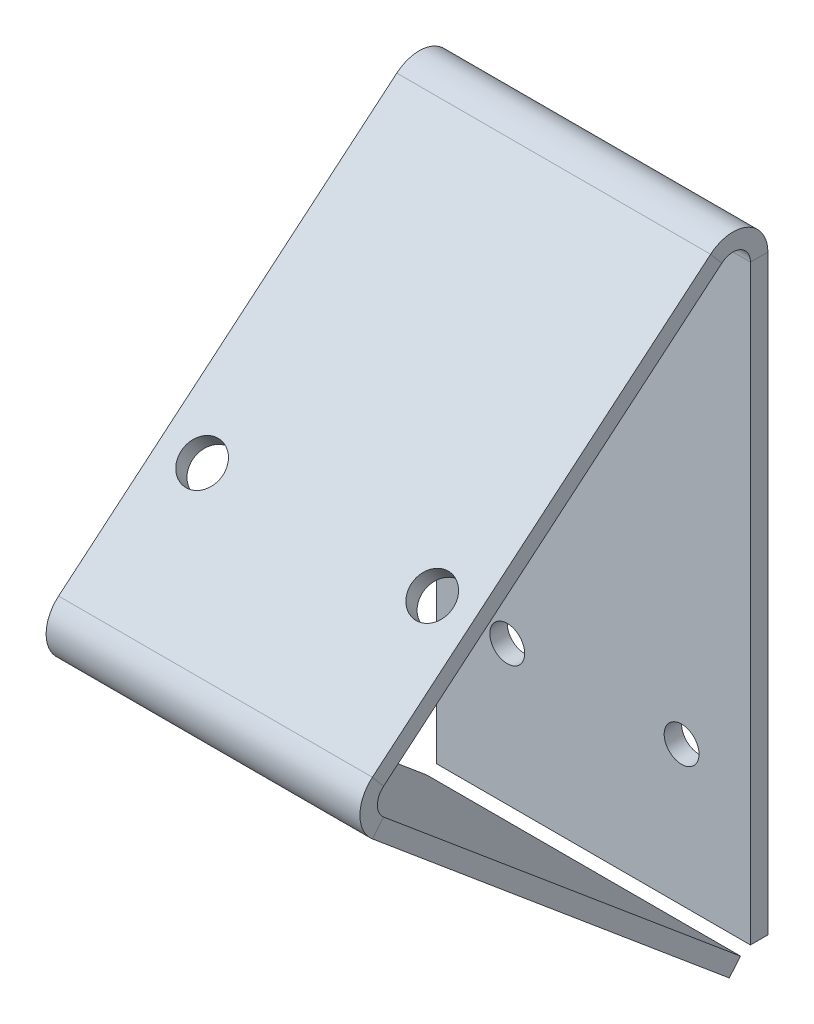
ISO-10303-21;
HEADER;
FILE_DESCRIPTION(('STEP AP214'),'2;1');
FILE_NAME('part.step','',(''),(''),'','','');
FILE_SCHEMA(('AUTOMOTIVE_DESIGN { 1 0 10303 214 1 1 1 1 }'));
ENDSEC;
DATA;
#1=APPLICATION_CONTEXT('core data for automotive mechanical design processes');
#2=APPLICATION_PROTOCOL_DEFINITION('international standard','automotive_design',2000,#1);
#3=PRODUCT_CONTEXT('',#1,'mechanical');
#4=PRODUCT('Part','Part','',(#3));
#5=PRODUCT_RELATED_PRODUCT_CATEGORY('part','',(#4));
#6=PRODUCT_DEFINITION_FORMATION('','',#4);
#7=PRODUCT_DEFINITION_CONTEXT('part definition',#1,'design');
#8=PRODUCT_DEFINITION('design','',#6,#7);
#9=PRODUCT_DEFINITION_SHAPE('','',#8);
#10=(LENGTH_UNIT() NAMED_UNIT(*) SI_UNIT(.MILLI.,.METRE.));
#11=(NAMED_UNIT(*) PLANE_ANGLE_UNIT() SI_UNIT($,.RADIAN.));
#12=(NAMED_UNIT(*) SI_UNIT($,.STERADIAN.) SOLID_ANGLE_UNIT());
#13=UNCERTAINTY_MEASURE_WITH_UNIT(LENGTH_MEASURE(1.E-05),#10,'distance_accuracy_value','');
#14=(GEOMETRIC_REPRESENTATION_CONTEXT(3) GLOBAL_UNCERTAINTY_ASSIGNED_CONTEXT((#13)) GLOBAL_UNIT_ASSIGNED_CONTEXT((#10,
#11,#12)) REPRESENTATION_CONTEXT('',''));
#15=CARTESIAN_POINT('',(0.,0.,0.));
#16=DIRECTION('',(0.,0.,1.));
#17=DIRECTION('',(1.,0.,0.));
#18=AXIS2_PLACEMENT_3D('',#15,#16,#17);
#19=CARTESIAN_POINT('',(-216.953914114597,121.828309810006,102.226089828528));
#20=DIRECTION('',(1.,0.,0.));
#21=DIRECTION('',(0.,-0.642787609686543,0.766044443118975));
#22=AXIS2_PLACEMENT_3D('',#19,#20,#21);
#23=PLANE('',#22);
#24=DIRECTION('',(0.,0.766044443118975,0.642787609686543));
#25=VECTOR('',#24,1.);
#26=CARTESIAN_POINT('',(-216.953914114597,142.748478512065,77.2944036201722));
#27=LINE('',#26,#25);
#28=CARTESIAN_POINT('',(-216.953914114597,140.316287405162,75.2535529594174));
#29=VERTEX_POINT('',#28);
#30=CARTESIAN_POINT('',(-216.953914114597,142.748478512065,77.2944036201722));
#31=VERTEX_POINT('',#30);
#32=EDGE_CURVE('E12',#29,#31,#27,.T.);
#33=ORIENTED_EDGE('',*,*,#32,.F.);
#34=DIRECTION('',(0.,0.642787609686543,-0.766044443118975));
#35=VECTOR('',#34,1.);
#36=CARTESIAN_POINT('',(-216.953914114597,119.396118703103,100.185239167773));
#37=LINE('',#36,#35);
#38=CARTESIAN_POINT('',(-216.953914114597,192.001158760502,13.657921838922));
#39=VERTEX_POINT('',#38);
#40=EDGE_CURVE('E166',#39,#29,#37,.F.);
#41=ORIENTED_EDGE('',*,*,#40,.F.);
#42=DIRECTION('',(0.,0.766044443118974,0.642787609686544));
#43=VECTOR('',#42,1.);
#44=CARTESIAN_POINT('',(-216.953914114597,194.433349867405,15.6987724996768));
#45=LINE('',#44,#43);
#46=CARTESIAN_POINT('',(-216.953914114597,194.433349867405,15.6987724996768));
#47=VERTEX_POINT('',#46);
#48=EDGE_CURVE('E56',#39,#47,#45,.T.);
#49=ORIENTED_EDGE('',*,*,#48,.T.);
#50=DIRECTION('',(0.,-0.642787609686543,0.766044443118975));
#51=VECTOR('',#50,1.);
#52=CARTESIAN_POINT('',(-216.953914114597,121.828309810006,102.226089828528));
#53=LINE('',#52,#51);
#54=EDGE_CURVE('E264',#47,#31,#53,.T.);
#55=ORIENTED_EDGE('',*,*,#54,.T.);
#56=EDGE_LOOP('',(#33,#41,#49,#55));
#57=FACE_BOUND('',#56,.T.);
#58=ADVANCED_FACE('F46',(#57),#23,.T.);
#59=CARTESIAN_POINT('',(-216.953914114597,189.5689676536,11.6170711781672));
#60=DIRECTION('',(-1.,0.,0.));
#61=DIRECTION('',(0.,0.,1.));
#62=AXIS2_PLACEMENT_3D('',#59,#60,#61);
#63=PLANE('',#62);
#64=ORIENTED_EDGE('',*,*,#48,.F.);
#65=CARTESIAN_POINT('',(-216.953914114597,189.5689676536,11.6170711781672));
#66=DIRECTION('',(-1.,0.,0.));
#67=DIRECTION('',(0.,0.,1.));
#68=AXIS2_PLACEMENT_3D('',#65,#66,#67);
#69=CIRCLE('',#68,3.175);
#70=CARTESIAN_POINT('',(-216.953914114597,189.5689676536,8.44207117816722));
#71=VERTEX_POINT('',#70);
#72=EDGE_CURVE('E170',#39,#71,#69,.T.);
#73=ORIENTED_EDGE('',*,*,#72,.T.);
#74=DIRECTION('',(0.,0.,-1.));
#75=VECTOR('',#74,1.);
#76=CARTESIAN_POINT('',(-216.953914114597,189.5689676536,5.26707117816722));
#77=LINE('',#76,#75);
#78=CARTESIAN_POINT('',(-216.953914114597,189.5689676536,5.26707117816722));
#79=VERTEX_POINT('',#78);
#80=EDGE_CURVE('E204',#71,#79,#77,.T.);
#81=ORIENTED_EDGE('',*,*,#80,.T.);
#82=CARTESIAN_POINT('',(-216.953914114597,189.5689676536,11.6170711781672));
#83=DIRECTION('',(1.,0.,0.));
#84=DIRECTION('',(0.,0.,-1.));
#85=AXIS2_PLACEMENT_3D('',#82,#83,#84);
#86=CIRCLE('',#85,6.35);
#87=EDGE_CURVE('E281',#47,#79,#86,.F.);
#88=ORIENTED_EDGE('',*,*,#87,.F.);
#89=EDGE_LOOP('',(#64,#73,#81,#88));
#90=FACE_BOUND('',#89,.T.);
#91=ADVANCED_FACE('F300',(#90),#63,.F.);
#92=CARTESIAN_POINT('',(-216.953914114597,0.,5.26707117816726));
#93=DIRECTION('',(1.,0.,0.));
#94=DIRECTION('',(0.,1.,0.));
#95=AXIS2_PLACEMENT_3D('',#92,#93,#94);
#96=PLANE('',#95);
#97=ORIENTED_EDGE('',*,*,#80,.F.);
#98=DIRECTION('',(0.,-1.,0.));
#99=VECTOR('',#98,1.);
#100=CARTESIAN_POINT('',(-216.953914114597,0.,8.44207117816726));
#101=LINE('',#100,#99);
#102=CARTESIAN_POINT('',(-216.953914114597,81.8630845770558,8.44207117816724));
#103=VERTEX_POINT('',#102);
#104=EDGE_CURVE('E156',#103,#71,#101,.F.);
#105=ORIENTED_EDGE('',*,*,#104,.F.);
#106=DIRECTION('',(0.,0.,-1.));
#107=VECTOR('',#106,1.);
#108=CARTESIAN_POINT('',(-216.953914114597,81.8630845770558,5.26707117816724));
#109=LINE('',#108,#107);
#110=CARTESIAN_POINT('',(-216.953914114597,81.8630845770558,5.26707117816724));
#111=VERTEX_POINT('',#110);
#112=EDGE_CURVE('E201',#103,#111,#109,.T.);
#113=ORIENTED_EDGE('',*,*,#112,.T.);
#114=DIRECTION('',(0.,1.,0.));
#115=VECTOR('',#114,1.);
#116=CARTESIAN_POINT('',(-216.953914114597,0.,5.26707117816726));
#117=LINE('',#116,#115);
#118=EDGE_CURVE('E248',#111,#79,#117,.T.);
#119=ORIENTED_EDGE('',*,*,#118,.T.);
#120=EDGE_LOOP('',(#97,#105,#113,#119));
#121=FACE_BOUND('',#120,.T.);
#122=ADVANCED_FACE('F246',(#121),#96,.T.);
#123=CARTESIAN_POINT('',(-216.953914114597,81.8630845770558,5.26707117816724));
#124=DIRECTION('',(0.,1.,0.));
#125=DIRECTION('',(-1.,0.,0.));
#126=AXIS2_PLACEMENT_3D('',#123,#124,#125);
#127=PLANE('',#126);
#128=ORIENTED_EDGE('',*,*,#112,.F.);
#129=DIRECTION('',(1.,0.,0.));
#130=VECTOR('',#129,1.);
#131=CARTESIAN_POINT('',(-216.953914114597,81.8630845770558,8.44207117816724));
#132=LINE('',#131,#130);
#133=CARTESIAN_POINT('',(-274.103914114597,81.8630845770558,8.44207117816724));
#134=VERTEX_POINT('',#133);
#135=EDGE_CURVE('E151',#103,#134,#132,.F.);
#136=ORIENTED_EDGE('',*,*,#135,.T.);
#137=DIRECTION('',(0.,0.,-1.));
#138=VECTOR('',#137,1.);
#139=CARTESIAN_POINT('',(-274.103914114597,81.8630845770558,5.26707117816724));
#140=LINE('',#139,#138);
#141=CARTESIAN_POINT('',(-274.103914114597,81.8630845770558,5.26707117816724));
#142=VERTEX_POINT('',#141);
#143=EDGE_CURVE('E198',#134,#142,#140,.T.);
#144=ORIENTED_EDGE('',*,*,#143,.T.);
#145=DIRECTION('',(-1.,0.,0.));
#146=VECTOR('',#145,1.);
#147=CARTESIAN_POINT('',(-216.953914114597,81.8630845770558,5.26707117816724));
#148=LINE('',#147,#146);
#149=EDGE_CURVE('E242',#111,#142,#148,.T.);
#150=ORIENTED_EDGE('',*,*,#149,.F.);
#151=EDGE_LOOP('',(#128,#136,#144,#150));
#152=FACE_BOUND('',#151,.T.);
#153=ADVANCED_FACE('F238',(#152),#127,.F.);
#154=CARTESIAN_POINT('',(-274.103914114597,0.,5.26707117816726));
#155=DIRECTION('',(1.,0.,0.));
#156=DIRECTION('',(0.,1.,0.));
#157=AXIS2_PLACEMENT_3D('',#154,#155,#156);
#158=PLANE('',#157);
#159=ORIENTED_EDGE('',*,*,#143,.F.);
#160=DIRECTION('',(0.,-1.,0.));
#161=VECTOR('',#160,1.);
#162=CARTESIAN_POINT('',(-274.103914114597,0.,8.44207117816726));
#163=LINE('',#162,#161);
#164=CARTESIAN_POINT('',(-274.103914114597,189.5689676536,8.44207117816721));
#165=VERTEX_POINT('',#164);
#166=EDGE_CURVE('E171',#134,#165,#163,.F.);
#167=ORIENTED_EDGE('',*,*,#166,.T.);
#168=DIRECTION('',(0.,0.,-1.));
#169=VECTOR('',#168,1.);
#170=CARTESIAN_POINT('',(-274.103914114597,189.5689676536,5.26707117816722));
#171=LINE('',#170,#169);
#172=CARTESIAN_POINT('',(-274.103914114597,189.5689676536,5.26707117816722));
#173=VERTEX_POINT('',#172);
#174=EDGE_CURVE('E195',#165,#173,#171,.T.);
#175=ORIENTED_EDGE('',*,*,#174,.T.);
#176=DIRECTION('',(0.,1.,0.));
#177=VECTOR('',#176,1.);
#178=CARTESIAN_POINT('',(-274.103914114597,0.,5.26707117816726));
#179=LINE('',#178,#177);
#180=EDGE_CURVE('E259',#142,#173,#179,.T.);
#181=ORIENTED_EDGE('',*,*,#180,.F.);
#182=EDGE_LOOP('',(#159,#167,#175,#181));
#183=FACE_BOUND('',#182,.T.);
#184=ADVANCED_FACE('F311',(#183),#158,.F.);
#185=CARTESIAN_POINT('',(-274.103914114597,189.5689676536,11.6170711781672));
#186=DIRECTION('',(1.,0.,0.));
#187=DIRECTION('',(0.,0.,-1.));
#188=AXIS2_PLACEMENT_3D('',#185,#186,#187);
#189=PLANE('',#188);
#190=ORIENTED_EDGE('',*,*,#174,.F.);
#191=CARTESIAN_POINT('',(-274.103914114597,189.5689676536,11.6170711781672));
#192=DIRECTION('',(-1.,0.,0.));
#193=DIRECTION('',(0.,0.,1.));
#194=AXIS2_PLACEMENT_3D('',#191,#192,#193);
#195=CIRCLE('',#194,3.175);
#196=CARTESIAN_POINT('',(-274.103914114597,192.001158760502,13.657921838922));
#197=VERTEX_POINT('',#196);
#198=EDGE_CURVE('E146',#165,#197,#195,.F.);
#199=ORIENTED_EDGE('',*,*,#198,.T.);
#200=DIRECTION('',(0.,0.766044443118975,0.642787609686543));
#201=VECTOR('',#200,1.);
#202=CARTESIAN_POINT('',(-274.103914114597,194.433349867405,15.6987724996768));
#203=LINE('',#202,#201);
#204=CARTESIAN_POINT('',(-274.103914114597,194.433349867405,15.6987724996768));
#205=VERTEX_POINT('',#204);
#206=EDGE_CURVE('E192',#197,#205,#203,.T.);
#207=ORIENTED_EDGE('',*,*,#206,.T.);
#208=CARTESIAN_POINT('',(-274.103914114597,189.5689676536,11.6170711781672));
#209=DIRECTION('',(-1.,0.,0.));
#210=DIRECTION('',(0.,0.,1.));
#211=AXIS2_PLACEMENT_3D('',#208,#209,#210);
#212=CIRCLE('',#211,6.35);
#213=EDGE_CURVE('E278',#173,#205,#212,.F.);
#214=ORIENTED_EDGE('',*,*,#213,.F.);
#215=EDGE_LOOP('',(#190,#199,#207,#214));
#216=FACE_BOUND('',#215,.T.);
#217=ADVANCED_FACE('F307',(#216),#189,.F.);
#218=CARTESIAN_POINT('',(-274.103914114597,121.828309810006,102.226089828528));
#219=DIRECTION('',(1.,0.,0.));
#220=DIRECTION('',(0.,-0.642787609686543,0.766044443118975));
#221=AXIS2_PLACEMENT_3D('',#218,#219,#220);
#222=PLANE('',#221);
#223=ORIENTED_EDGE('',*,*,#206,.F.);
#224=DIRECTION('',(0.,0.642787609686543,-0.766044443118975));
#225=VECTOR('',#224,1.);
#226=CARTESIAN_POINT('',(-274.103914114597,119.396118703103,100.185239167773));
#227=LINE('',#226,#225);
#228=CARTESIAN_POINT('',(-274.103914114597,140.316287405162,75.2535529594174));
#229=VERTEX_POINT('',#228);
#230=EDGE_CURVE('E164',#197,#229,#227,.F.);
#231=ORIENTED_EDGE('',*,*,#230,.T.);
#232=DIRECTION('',(0.,0.766044443118975,0.642787609686543));
#233=VECTOR('',#232,1.);
#234=CARTESIAN_POINT('',(-274.103914114597,142.748478512065,77.2944036201722));
#235=LINE('',#234,#233);
#236=CARTESIAN_POINT('',(-274.103914114597,142.748478512065,77.2944036201722));
#237=VERTEX_POINT('',#236);
#238=EDGE_CURVE('E65',#229,#237,#235,.T.);
#239=ORIENTED_EDGE('',*,*,#238,.T.);
#240=DIRECTION('',(0.,-0.642787609686543,0.766044443118975));
#241=VECTOR('',#240,1.);
#242=CARTESIAN_POINT('',(-274.103914114597,121.828309810006,102.226089828528));
#243=LINE('',#242,#241);
#244=EDGE_CURVE('E648',#205,#237,#243,.T.);
#245=ORIENTED_EDGE('',*,*,#244,.F.);
#246=EDGE_LOOP('',(#223,#231,#239,#245));
#247=FACE_BOUND('',#246,.T.);
#248=ADVANCED_FACE('F528',(#247),#222,.F.);
#249=CARTESIAN_POINT('',(-274.103914114597,137.88409629826,73.2127022986627));
#250=DIRECTION('',(1.,0.,0.));
#251=DIRECTION('',(0.,0.,-1.));
#252=AXIS2_PLACEMENT_3D('',#249,#250,#251);
#253=PLANE('',#252);
#254=ORIENTED_EDGE('',*,*,#238,.F.);
#255=CARTESIAN_POINT('',(-274.103914114597,137.88409629826,73.2127022986627));
#256=DIRECTION('',(-1.,0.,0.));
#257=DIRECTION('',(0.,0.,1.));
#258=AXIS2_PLACEMENT_3D('',#255,#256,#257);
#259=CIRCLE('',#258,3.175);
#260=CARTESIAN_POINT('',(-274.103914114597,135.449952750407,75.2512238679499));
#261=VERTEX_POINT('',#260);
#262=EDGE_CURVE('E147',#229,#261,#259,.F.);
#263=ORIENTED_EDGE('',*,*,#262,.T.);
#264=DIRECTION('',(0.,-0.766659385150302,0.642054037570795));
#265=VECTOR('',#264,1.);
#266=CARTESIAN_POINT('',(-274.103914114597,133.015809202555,77.2897454372372));
#267=LINE('',#266,#265);
#268=CARTESIAN_POINT('',(-274.103914114597,133.015809202555,77.2897454372372));
#269=VERTEX_POINT('',#268);
#270=EDGE_CURVE('E188',#261,#269,#267,.T.);
#271=ORIENTED_EDGE('',*,*,#270,.T.);
#272=CARTESIAN_POINT('',(-274.103914114597,137.88409629826,73.2127022986627));
#273=DIRECTION('',(-1.,0.,0.));
#274=DIRECTION('',(0.,0.,1.));
#275=AXIS2_PLACEMENT_3D('',#272,#273,#274);
#276=CIRCLE('',#275,6.35);
#277=EDGE_CURVE('E289',#237,#269,#276,.F.);
#278=ORIENTED_EDGE('',*,*,#277,.F.);
#279=EDGE_LOOP('',(#254,#263,#271,#278));
#280=FACE_BOUND('',#279,.T.);
#281=ADVANCED_FACE('F338',(#280),#253,.F.);
#282=CARTESIAN_POINT('',(-274.103914114597,40.1373982424596,-33.6138565552235));
#283=DIRECTION('',(1.,0.,0.));
#284=DIRECTION('',(0.,-0.642054037570795,-0.766659385150302));
#285=AXIS2_PLACEMENT_3D('',#282,#283,#284);
#286=PLANE('',#285);
#287=ORIENTED_EDGE('',*,*,#270,.F.);
#288=DIRECTION('',(0.,0.642054037570795,0.766659385150303));
#289=VECTOR('',#288,1.);
#290=CARTESIAN_POINT('',(-274.103914114597,42.5715417903118,-35.6523781245108));
#291=LINE('',#290,#289);
#292=CARTESIAN_POINT('',(-274.103914114597,81.0169806089417,10.254282003414));
#293=VERTEX_POINT('',#292);
#294=EDGE_CURVE('E136',#261,#293,#291,.F.);
#295=ORIENTED_EDGE('',*,*,#294,.T.);
#296=DIRECTION('',(0.,-0.766659385150302,0.642054037570795));
#297=VECTOR('',#296,1.);
#298=CARTESIAN_POINT('',(-274.103914114597,78.5828370610895,12.2928035727013));
#299=LINE('',#298,#297);
#300=CARTESIAN_POINT('',(-274.103914114597,78.5828370610895,12.2928035727013));
#301=VERTEX_POINT('',#300);
#302=EDGE_CURVE('E185',#293,#301,#299,.T.);
#303=ORIENTED_EDGE('',*,*,#302,.T.);
#304=DIRECTION('',(0.,-0.642054037570795,-0.766659385150302));
#305=VECTOR('',#304,1.);
#306=CARTESIAN_POINT('',(-274.103914114597,40.1373982424596,-33.6138565552235));
#307=LINE('',#306,#305);
#308=EDGE_CURVE('E258',#269,#301,#307,.T.);
#309=ORIENTED_EDGE('',*,*,#308,.F.);
#310=EDGE_LOOP('',(#287,#295,#303,#309));
#311=FACE_BOUND('',#310,.T.);
#312=ADVANCED_FACE('F324',(#311),#286,.F.);
#313=CARTESIAN_POINT('',(-216.953914114597,78.5828370610895,12.2928035727013));
#314=DIRECTION('',(0.,0.642054037570795,0.766659385150303));
#315=DIRECTION('',(1.,0.,0.));
#316=AXIS2_PLACEMENT_3D('',#313,#314,#315);
#317=PLANE('',#316);
#318=ORIENTED_EDGE('',*,*,#302,.F.);
#319=DIRECTION('',(1.,0.,0.));
#320=VECTOR('',#319,1.);
#321=CARTESIAN_POINT('',(-216.953914114597,81.0169806089417,10.254282003414));
#322=LINE('',#321,#320);
#323=CARTESIAN_POINT('',(-216.953914114597,81.0169806089417,10.254282003414));
#324=VERTEX_POINT('',#323);
#325=EDGE_CURVE('E154',#293,#324,#322,.T.);
#326=ORIENTED_EDGE('',*,*,#325,.T.);
#327=DIRECTION('',(0.,-0.766659385150302,0.642054037570795));
#328=VECTOR('',#327,1.);
#329=CARTESIAN_POINT('',(-216.953914114597,78.5828370610895,12.2928035727013));
#330=LINE('',#329,#328);
#331=CARTESIAN_POINT('',(-216.953914114597,78.5828370610895,12.2928035727013));
#332=VERTEX_POINT('',#331);
#333=EDGE_CURVE('E123',#324,#332,#330,.T.);
#334=ORIENTED_EDGE('',*,*,#333,.T.);
#335=DIRECTION('',(1.,0.,0.));
#336=VECTOR('',#335,1.);
#337=CARTESIAN_POINT('',(-216.953914114597,78.5828370610895,12.2928035727013));
#338=LINE('',#337,#336);
#339=EDGE_CURVE('E270',#301,#332,#338,.T.);
#340=ORIENTED_EDGE('',*,*,#339,.F.);
#341=EDGE_LOOP('',(#318,#326,#334,#340));
#342=FACE_BOUND('',#341,.T.);
#343=ADVANCED_FACE('F329',(#342),#317,.F.);
#344=CARTESIAN_POINT('',(-216.953914114597,40.1373982424596,-33.6138565552235));
#345=DIRECTION('',(1.,0.,0.));
#346=DIRECTION('',(0.,-0.642054037570795,-0.766659385150302));
#347=AXIS2_PLACEMENT_3D('',#344,#345,#346);
#348=PLANE('',#347);
#349=ORIENTED_EDGE('',*,*,#333,.F.);
#350=DIRECTION('',(0.,0.642054037570795,0.766659385150303));
#351=VECTOR('',#350,1.);
#352=CARTESIAN_POINT('',(-216.953914114597,42.5715417903118,-35.6523781245108));
#353=LINE('',#352,#351);
#354=CARTESIAN_POINT('',(-216.953914114597,135.449952750407,75.25122386795));
#355=VERTEX_POINT('',#354);
#356=EDGE_CURVE('E133',#355,#324,#353,.F.);
#357=ORIENTED_EDGE('',*,*,#356,.F.);
#358=DIRECTION('',(0.,-0.766659385150302,0.642054037570796));
#359=VECTOR('',#358,1.);
#360=CARTESIAN_POINT('',(-216.953914114597,133.015809202555,77.2897454372372));
#361=LINE('',#360,#359);
#362=CARTESIAN_POINT('',(-216.953914114597,133.015809202555,77.2897454372372));
#363=VERTEX_POINT('',#362);
#364=EDGE_CURVE('E111',#355,#363,#361,.T.);
#365=ORIENTED_EDGE('',*,*,#364,.T.);
#366=DIRECTION('',(0.,-0.642054037570795,-0.766659385150302));
#367=VECTOR('',#366,1.);
#368=CARTESIAN_POINT('',(-216.953914114597,40.1373982424596,-33.6138565552235));
#369=LINE('',#368,#367);
#370=EDGE_CURVE('E262',#363,#332,#369,.T.);
#371=ORIENTED_EDGE('',*,*,#370,.T.);
#372=EDGE_LOOP('',(#349,#357,#365,#371));
#373=FACE_BOUND('',#372,.T.);
#374=ADVANCED_FACE('F149',(#373),#348,.T.);
#375=CARTESIAN_POINT('',(-266.483914114597,158.28787206223,58.7752755300277));
#376=DIRECTION('',(0.,-0.766044443118975,-0.642787609686543));
#377=DIRECTION('',(0.,0.642787609686543,-0.766044443118975));
#378=AXIS2_PLACEMENT_3D('',#375,#376,#377);
#379=CYLINDRICAL_SURFACE('',#378,3.80999999999998);
#380=CARTESIAN_POINT('',(-266.483914114597,158.28787206223,58.7752755300277));
#381=DIRECTION('',(0.,0.766044443118975,0.642787609686543));
#382=DIRECTION('',(0.,-0.642787609686543,0.766044443118975));
#383=AXIS2_PLACEMENT_3D('',#380,#381,#382);
#384=CIRCLE('',#383,3.80999999999998);
#385=CARTESIAN_POINT('',(-266.483914114597,155.838851269325,61.6939048583109));
#386=VERTEX_POINT('',#385);
#387=EDGE_CURVE('E284',#386,#386,#384,.T.);
#388=ORIENTED_EDGE('',*,*,#387,.T.);
#389=EDGE_LOOP('',(#388));
#390=FACE_BOUND('',#389,.T.);
#391=CARTESIAN_POINT('',(-266.483914114597,155.855680955328,56.7344248692729));
#392=DIRECTION('',(0.,0.766044443118975,0.642787609686543));
#393=DIRECTION('',(0.,-0.642787609686543,0.766044443118975));
#394=AXIS2_PLACEMENT_3D('',#391,#392,#393);
#395=CIRCLE('',#394,3.80999999999998);
#396=CARTESIAN_POINT('',(-266.483914114597,153.406660162422,59.6530541975562));
#397=VERTEX_POINT('',#396);
#398=EDGE_CURVE('E178',#397,#397,#395,.T.);
#399=ORIENTED_EDGE('',*,*,#398,.F.);
#400=EDGE_LOOP('',(#399));
#401=FACE_BOUND('',#400,.T.);
#402=ADVANCED_FACE('F336',(#390,#401),#379,.F.);
#403=CARTESIAN_POINT('',(-224.573914114597,158.28787206223,58.7752755300276));
#404=DIRECTION('',(0.,-0.766044443118975,-0.642787609686543));
#405=DIRECTION('',(0.,0.642787609686543,-0.766044443118975));
#406=AXIS2_PLACEMENT_3D('',#403,#404,#405);
#407=CYLINDRICAL_SURFACE('',#406,3.81000000000002);
#408=CARTESIAN_POINT('',(-224.573914114597,158.28787206223,58.7752755300276));
#409=DIRECTION('',(0.,0.766044443118975,0.642787609686543));
#410=DIRECTION('',(0.,-0.642787609686543,0.766044443118975));
#411=AXIS2_PLACEMENT_3D('',#408,#409,#410);
#412=CIRCLE('',#411,3.81000000000002);
#413=CARTESIAN_POINT('',(-224.573914114597,155.838851269325,61.693904858311));
#414=VERTEX_POINT('',#413);
#415=EDGE_CURVE('E649',#414,#414,#412,.T.);
#416=ORIENTED_EDGE('',*,*,#415,.T.);
#417=EDGE_LOOP('',(#416));
#418=FACE_BOUND('',#417,.T.);
#419=CARTESIAN_POINT('',(-224.573914114597,155.855680955328,56.7344248692729));
#420=DIRECTION('',(0.,0.766044443118975,0.642787609686543));
#421=DIRECTION('',(0.,-0.642787609686543,0.766044443118975));
#422=AXIS2_PLACEMENT_3D('',#419,#420,#421);
#423=CIRCLE('',#422,3.81000000000002);
#424=CARTESIAN_POINT('',(-224.573914114597,153.406660162422,59.6530541975562));
#425=VERTEX_POINT('',#424);
#426=EDGE_CURVE('E167',#425,#425,#423,.T.);
#427=ORIENTED_EDGE('',*,*,#426,.F.);
#428=EDGE_LOOP('',(#427));
#429=FACE_BOUND('',#428,.T.);
#430=ADVANCED_FACE('F48',(#418,#429),#407,.F.);
#431=CARTESIAN_POINT('',(-216.953914114597,137.88409629826,73.2127022986627));
#432=DIRECTION('',(-1.,0.,0.));
#433=DIRECTION('',(0.,0.,1.));
#434=AXIS2_PLACEMENT_3D('',#431,#432,#433);
#435=PLANE('',#434);
#436=CARTESIAN_POINT('',(-216.953914114597,137.88409629826,73.2127022986627));
#437=DIRECTION('',(-1.,0.,0.));
#438=DIRECTION('',(0.,0.,1.));
#439=AXIS2_PLACEMENT_3D('',#436,#437,#438);
#440=CIRCLE('',#439,3.175);
#441=EDGE_CURVE('E115',#355,#29,#440,.T.);
#442=ORIENTED_EDGE('',*,*,#441,.T.);
#443=ORIENTED_EDGE('',*,*,#32,.T.);
#444=CARTESIAN_POINT('',(-216.953914114597,137.88409629826,73.2127022986627));
#445=DIRECTION('',(1.,0.,0.));
#446=DIRECTION('',(0.,0.,-1.));
#447=AXIS2_PLACEMENT_3D('',#444,#445,#446);
#448=CIRCLE('',#447,6.35);
#449=EDGE_CURVE('E117',#363,#31,#448,.F.);
#450=ORIENTED_EDGE('',*,*,#449,.F.);
#451=ORIENTED_EDGE('',*,*,#364,.F.);
#452=EDGE_LOOP('',(#442,#443,#450,#451));
#453=FACE_BOUND('',#452,.T.);
#454=ADVANCED_FACE('F113',(#453),#435,.F.);
#455=CARTESIAN_POINT('',(-216.953914114597,40.1373982424596,-33.6138565552235));
#456=DIRECTION('',(0.,0.766659385150302,-0.642054037570795));
#457=DIRECTION('',(0.,0.642054037570795,0.766659385150303));
#458=AXIS2_PLACEMENT_3D('',#455,#456,#457);
#459=PLANE('',#458);
#460=ORIENTED_EDGE('',*,*,#370,.F.);
#461=DIRECTION('',(-1.,0.,0.));
#462=VECTOR('',#461,1.);
#463=CARTESIAN_POINT('',(-216.953914114597,133.015809202555,77.2897454372372));
#464=LINE('',#463,#462);
#465=EDGE_CURVE('E277',#363,#269,#464,.T.);
#466=ORIENTED_EDGE('',*,*,#465,.T.);
#467=ORIENTED_EDGE('',*,*,#308,.T.);
#468=ORIENTED_EDGE('',*,*,#339,.T.);
#469=EDGE_LOOP('',(#460,#466,#467,#468));
#470=FACE_BOUND('',#469,.T.);
#471=ADVANCED_FACE('F328',(#470),#459,.F.);
#472=CARTESIAN_POINT('',(-216.953914114597,0.,5.26707117816726));
#473=DIRECTION('',(0.,0.,1.));
#474=DIRECTION('',(0.,-1.,0.));
#475=AXIS2_PLACEMENT_3D('',#472,#473,#474);
#476=PLANE('',#475);
#477=CARTESIAN_POINT('',(-229.494923600473,107.263084577056,5.26707117816726));
#478=DIRECTION('',(0.,0.,-1.));
#479=DIRECTION('',(-1.,0.,0.));
#480=AXIS2_PLACEMENT_3D('',#477,#478,#479);
#481=CIRCLE('',#480,3.175);
#482=CARTESIAN_POINT('',(-232.669923600473,107.263084577056,5.26707117816726));
#483=VERTEX_POINT('',#482);
#484=EDGE_CURVE('E212',#483,#483,#481,.T.);
#485=ORIENTED_EDGE('',*,*,#484,.F.);
#486=EDGE_LOOP('',(#485));
#487=FACE_BOUND('',#486,.T.);
#488=CARTESIAN_POINT('',(-261.244923600473,107.263084577056,5.26707117816726));
#489=DIRECTION('',(0.,0.,-1.));
#490=DIRECTION('',(-1.,0.,0.));
#491=AXIS2_PLACEMENT_3D('',#488,#489,#490);
#492=CIRCLE('',#491,3.17500000000003);
#493=CARTESIAN_POINT('',(-264.419923600473,107.263084577056,5.26707117816726));
#494=VERTEX_POINT('',#493);
#495=EDGE_CURVE('E658',#494,#494,#492,.T.);
#496=ORIENTED_EDGE('',*,*,#495,.F.);
#497=EDGE_LOOP('',(#496));
#498=FACE_BOUND('',#497,.T.);
#499=CARTESIAN_POINT('',(-245.369923600473,151.713084577056,5.26707117816726));
#500=DIRECTION('',(0.,0.,-1.));
#501=DIRECTION('',(-1.,0.,0.));
#502=AXIS2_PLACEMENT_3D('',#499,#500,#501);
#503=CIRCLE('',#502,3.17499999999997);
#504=CARTESIAN_POINT('',(-248.544923600473,151.713084577056,5.26707117816726));
#505=VERTEX_POINT('',#504);
#506=EDGE_CURVE('E655',#505,#505,#503,.T.);
#507=ORIENTED_EDGE('',*,*,#506,.F.);
#508=EDGE_LOOP('',(#507));
#509=FACE_BOUND('',#508,.T.);
#510=ORIENTED_EDGE('',*,*,#180,.T.);
#511=DIRECTION('',(-1.,0.,0.));
#512=VECTOR('',#511,1.);
#513=CARTESIAN_POINT('',(-216.953914114597,189.5689676536,5.26707117816722));
#514=LINE('',#513,#512);
#515=EDGE_CURVE('E257',#173,#79,#514,.F.);
#516=ORIENTED_EDGE('',*,*,#515,.T.);
#517=ORIENTED_EDGE('',*,*,#118,.F.);
#518=ORIENTED_EDGE('',*,*,#149,.T.);
#519=EDGE_LOOP('',(#510,#516,#517,#518));
#520=FACE_BOUND('',#519,.T.);
#521=ADVANCED_FACE('F254',(#487,#498,#509,#520),#476,.F.);
#522=CARTESIAN_POINT('',(-216.953914114597,121.828309810006,102.226089828528));
#523=DIRECTION('',(0.,-0.766044443118975,-0.642787609686543));
#524=DIRECTION('',(0.,0.642787609686543,-0.766044443118975));
#525=AXIS2_PLACEMENT_3D('',#522,#523,#524);
#526=PLANE('',#525);
#527=ORIENTED_EDGE('',*,*,#387,.F.);
#528=EDGE_LOOP('',(#527));
#529=FACE_BOUND('',#528,.T.);
#530=ORIENTED_EDGE('',*,*,#415,.F.);
#531=EDGE_LOOP('',(#530));
#532=FACE_BOUND('',#531,.T.);
#533=ORIENTED_EDGE('',*,*,#244,.T.);
#534=DIRECTION('',(-1.,0.,0.));
#535=VECTOR('',#534,1.);
#536=CARTESIAN_POINT('',(-216.953914114597,142.748478512065,77.2944036201722));
#537=LINE('',#536,#535);
#538=EDGE_CURVE('E124',#237,#31,#537,.F.);
#539=ORIENTED_EDGE('',*,*,#538,.T.);
#540=ORIENTED_EDGE('',*,*,#54,.F.);
#541=DIRECTION('',(-1.,0.,0.));
#542=VECTOR('',#541,1.);
#543=CARTESIAN_POINT('',(-216.953914114597,194.433349867405,15.6987724996768));
#544=LINE('',#543,#542);
#545=EDGE_CURVE('E273',#47,#205,#544,.T.);
#546=ORIENTED_EDGE('',*,*,#545,.T.);
#547=EDGE_LOOP('',(#533,#539,#540,#546));
#548=FACE_BOUND('',#547,.T.);
#549=ADVANCED_FACE('F386',(#529,#532,#548),#526,.F.);
#550=CARTESIAN_POINT('',(-216.953914114597,189.5689676536,11.6170711781672));
#551=DIRECTION('',(-1.,0.,0.));
#552=DIRECTION('',(0.,0.,1.));
#553=AXIS2_PLACEMENT_3D('',#550,#551,#552);
#554=CYLINDRICAL_SURFACE('',#553,6.35);
#555=ORIENTED_EDGE('',*,*,#87,.T.);
#556=ORIENTED_EDGE('',*,*,#515,.F.);
#557=ORIENTED_EDGE('',*,*,#213,.T.);
#558=ORIENTED_EDGE('',*,*,#545,.F.);
#559=EDGE_LOOP('',(#555,#556,#557,#558));
#560=FACE_BOUND('',#559,.T.);
#561=ADVANCED_FACE('F389',(#560),#554,.T.);
#562=CARTESIAN_POINT('',(-216.953914114597,137.88409629826,73.2127022986627));
#563=DIRECTION('',(-1.,0.,0.));
#564=DIRECTION('',(0.,0.,1.));
#565=AXIS2_PLACEMENT_3D('',#562,#563,#564);
#566=CYLINDRICAL_SURFACE('',#565,6.35);
#567=ORIENTED_EDGE('',*,*,#449,.T.);
#568=ORIENTED_EDGE('',*,*,#538,.F.);
#569=ORIENTED_EDGE('',*,*,#277,.T.);
#570=ORIENTED_EDGE('',*,*,#465,.F.);
#571=EDGE_LOOP('',(#567,#568,#569,#570));
#572=FACE_BOUND('',#571,.T.);
#573=ADVANCED_FACE('F398',(#572),#566,.T.);
#574=CARTESIAN_POINT('',(-216.953914114597,42.5715417903118,-35.6523781245108));
#575=DIRECTION('',(0.,0.766659385150302,-0.642054037570795));
#576=DIRECTION('',(0.,0.642054037570795,0.766659385150303));
#577=AXIS2_PLACEMENT_3D('',#574,#575,#576);
#578=PLANE('',#577);
#579=ORIENTED_EDGE('',*,*,#356,.T.);
#580=ORIENTED_EDGE('',*,*,#325,.F.);
#581=ORIENTED_EDGE('',*,*,#294,.F.);
#582=DIRECTION('',(1.,0.,0.));
#583=VECTOR('',#582,1.);
#584=CARTESIAN_POINT('',(-216.953914114597,135.449952750407,75.25122386795));
#585=LINE('',#584,#583);
#586=EDGE_CURVE('E130',#355,#261,#585,.F.);
#587=ORIENTED_EDGE('',*,*,#586,.F.);
#588=EDGE_LOOP('',(#579,#580,#581,#587));
#589=FACE_BOUND('',#588,.T.);
#590=ADVANCED_FACE('F131',(#589),#578,.T.);
#591=CARTESIAN_POINT('',(-216.953914114597,0.,8.44207117816726));
#592=DIRECTION('',(0.,0.,1.));
#593=DIRECTION('',(0.,-1.,0.));
#594=AXIS2_PLACEMENT_3D('',#591,#592,#593);
#595=PLANE('',#594);
#596=CARTESIAN_POINT('',(-229.494923600473,107.263084577056,8.44207117816724));
#597=DIRECTION('',(0.,0.,1.));
#598=DIRECTION('',(0.,-1.,0.));
#599=AXIS2_PLACEMENT_3D('',#596,#597,#598);
#600=CIRCLE('',#599,3.175);
#601=CARTESIAN_POINT('',(-229.494923600473,104.088084577056,8.44207117816724));
#602=VERTEX_POINT('',#601);
#603=EDGE_CURVE('E50',#602,#602,#600,.T.);
#604=ORIENTED_EDGE('',*,*,#603,.F.);
#605=EDGE_LOOP('',(#604));
#606=FACE_BOUND('',#605,.T.);
#607=CARTESIAN_POINT('',(-261.244923600473,107.263084577056,8.44207117816724));
#608=DIRECTION('',(0.,0.,1.));
#609=DIRECTION('',(0.,-1.,0.));
#610=AXIS2_PLACEMENT_3D('',#607,#608,#609);
#611=CIRCLE('',#610,3.17500000000003);
#612=CARTESIAN_POINT('',(-261.244923600473,104.088084577056,8.44207117816724));
#613=VERTEX_POINT('',#612);
#614=EDGE_CURVE('E211',#613,#613,#611,.T.);
#615=ORIENTED_EDGE('',*,*,#614,.F.);
#616=EDGE_LOOP('',(#615));
#617=FACE_BOUND('',#616,.T.);
#618=CARTESIAN_POINT('',(-245.369923600473,151.713084577056,8.44207117816722));
#619=DIRECTION('',(0.,0.,1.));
#620=DIRECTION('',(0.,-1.,0.));
#621=AXIS2_PLACEMENT_3D('',#618,#619,#620);
#622=CIRCLE('',#621,3.17499999999997);
#623=CARTESIAN_POINT('',(-245.369923600473,148.538084577056,8.44207117816722));
#624=VERTEX_POINT('',#623);
#625=EDGE_CURVE('E209',#624,#624,#622,.T.);
#626=ORIENTED_EDGE('',*,*,#625,.F.);
#627=EDGE_LOOP('',(#626));
#628=FACE_BOUND('',#627,.T.);
#629=ORIENTED_EDGE('',*,*,#166,.F.);
#630=ORIENTED_EDGE('',*,*,#135,.F.);
#631=ORIENTED_EDGE('',*,*,#104,.T.);
#632=DIRECTION('',(1.,0.,0.));
#633=VECTOR('',#632,1.);
#634=CARTESIAN_POINT('',(-216.953914114597,189.5689676536,8.44207117816721));
#635=LINE('',#634,#633);
#636=EDGE_CURVE('E141',#165,#71,#635,.T.);
#637=ORIENTED_EDGE('',*,*,#636,.F.);
#638=EDGE_LOOP('',(#629,#630,#631,#637));
#639=FACE_BOUND('',#638,.T.);
#640=ADVANCED_FACE('F222',(#606,#617,#628,#639),#595,.T.);
#641=CARTESIAN_POINT('',(-216.953914114597,119.396118703103,100.185239167773));
#642=DIRECTION('',(0.,-0.766044443118975,-0.642787609686543));
#643=DIRECTION('',(0.,0.642787609686543,-0.766044443118975));
#644=AXIS2_PLACEMENT_3D('',#641,#642,#643);
#645=PLANE('',#644);
#646=ORIENTED_EDGE('',*,*,#398,.T.);
#647=EDGE_LOOP('',(#646));
#648=FACE_BOUND('',#647,.T.);
#649=ORIENTED_EDGE('',*,*,#426,.T.);
#650=EDGE_LOOP('',(#649));
#651=FACE_BOUND('',#650,.T.);
#652=ORIENTED_EDGE('',*,*,#230,.F.);
#653=DIRECTION('',(1.,0.,0.));
#654=VECTOR('',#653,1.);
#655=CARTESIAN_POINT('',(-216.953914114597,192.001158760502,13.657921838922));
#656=LINE('',#655,#654);
#657=EDGE_CURVE('E161',#39,#197,#656,.F.);
#658=ORIENTED_EDGE('',*,*,#657,.F.);
#659=ORIENTED_EDGE('',*,*,#40,.T.);
#660=DIRECTION('',(1.,0.,0.));
#661=VECTOR('',#660,1.);
#662=CARTESIAN_POINT('',(-216.953914114597,140.316287405162,75.2535529594174));
#663=LINE('',#662,#661);
#664=EDGE_CURVE('E140',#229,#29,#663,.T.);
#665=ORIENTED_EDGE('',*,*,#664,.F.);
#666=EDGE_LOOP('',(#652,#658,#659,#665));
#667=FACE_BOUND('',#666,.T.);
#668=ADVANCED_FACE('F225',(#648,#651,#667),#645,.T.);
#669=CARTESIAN_POINT('',(-216.953914114597,189.5689676536,11.6170711781672));
#670=DIRECTION('',(-1.,0.,0.));
#671=DIRECTION('',(0.,0.,1.));
#672=AXIS2_PLACEMENT_3D('',#669,#670,#671);
#673=CYLINDRICAL_SURFACE('',#672,3.175);
#674=ORIENTED_EDGE('',*,*,#72,.F.);
#675=ORIENTED_EDGE('',*,*,#657,.T.);
#676=ORIENTED_EDGE('',*,*,#198,.F.);
#677=ORIENTED_EDGE('',*,*,#636,.T.);
#678=EDGE_LOOP('',(#674,#675,#676,#677));
#679=FACE_BOUND('',#678,.T.);
#680=ADVANCED_FACE('F298',(#679),#673,.F.);
#681=CARTESIAN_POINT('',(-216.953914114597,137.88409629826,73.2127022986627));
#682=DIRECTION('',(-1.,0.,0.));
#683=DIRECTION('',(0.,0.,1.));
#684=AXIS2_PLACEMENT_3D('',#681,#682,#683);
#685=CYLINDRICAL_SURFACE('',#684,3.175);
#686=ORIENTED_EDGE('',*,*,#441,.F.);
#687=ORIENTED_EDGE('',*,*,#586,.T.);
#688=ORIENTED_EDGE('',*,*,#262,.F.);
#689=ORIENTED_EDGE('',*,*,#664,.T.);
#690=EDGE_LOOP('',(#686,#687,#688,#689));
#691=FACE_BOUND('',#690,.T.);
#692=ADVANCED_FACE('F143',(#691),#685,.F.);
#693=CARTESIAN_POINT('',(-245.369923600473,151.713084577056,11.1090711781673));
#694=DIRECTION('',(0.,0.,-1.));
#695=DIRECTION('',(-1.,0.,0.));
#696=AXIS2_PLACEMENT_3D('',#693,#694,#695);
#697=CYLINDRICAL_SURFACE('',#696,3.17499999999997);
#698=ORIENTED_EDGE('',*,*,#625,.T.);
#699=EDGE_LOOP('',(#698));
#700=FACE_BOUND('',#699,.T.);
#701=ORIENTED_EDGE('',*,*,#506,.T.);
#702=EDGE_LOOP('',(#701));
#703=FACE_BOUND('',#702,.T.);
#704=ADVANCED_FACE('F372',(#700,#703),#697,.F.);
#705=CARTESIAN_POINT('',(-261.244923600473,107.263084577056,11.1090711781673));
#706=DIRECTION('',(0.,0.,-1.));
#707=DIRECTION('',(-1.,0.,0.));
#708=AXIS2_PLACEMENT_3D('',#705,#706,#707);
#709=CYLINDRICAL_SURFACE('',#708,3.17500000000003);
#710=ORIENTED_EDGE('',*,*,#614,.T.);
#711=EDGE_LOOP('',(#710));
#712=FACE_BOUND('',#711,.T.);
#713=ORIENTED_EDGE('',*,*,#495,.T.);
#714=EDGE_LOOP('',(#713));
#715=FACE_BOUND('',#714,.T.);
#716=ADVANCED_FACE('F376',(#712,#715),#709,.F.);
#717=CARTESIAN_POINT('',(-229.494923600473,107.263084577056,11.1090711781673));
#718=DIRECTION('',(0.,0.,-1.));
#719=DIRECTION('',(-1.,0.,0.));
#720=AXIS2_PLACEMENT_3D('',#717,#718,#719);
#721=CYLINDRICAL_SURFACE('',#720,3.175);
#722=ORIENTED_EDGE('',*,*,#603,.T.);
#723=EDGE_LOOP('',(#722));
#724=FACE_BOUND('',#723,.T.);
#725=ORIENTED_EDGE('',*,*,#484,.T.);
#726=EDGE_LOOP('',(#725));
#727=FACE_BOUND('',#726,.T.);
#728=ADVANCED_FACE('F219',(#724,#727),#721,.F.);
#729=CLOSED_SHELL('',(#58,#91,#122,#153,#184,#217,#248,#281,#312,#343,#374,#402,#430,#454,#471,
#521,#549,#561,#573,#590,#640,#668,#680,#692,#704,#716,#728));
#730=MANIFOLD_SOLID_BREP('B2',#729);
#731=ADVANCED_BREP_SHAPE_REPRESENTATION('',(#18,#730),#14);
#732=SHAPE_DEFINITION_REPRESENTATION(#9,#731);
ENDSEC;
END-ISO-10303-21;
